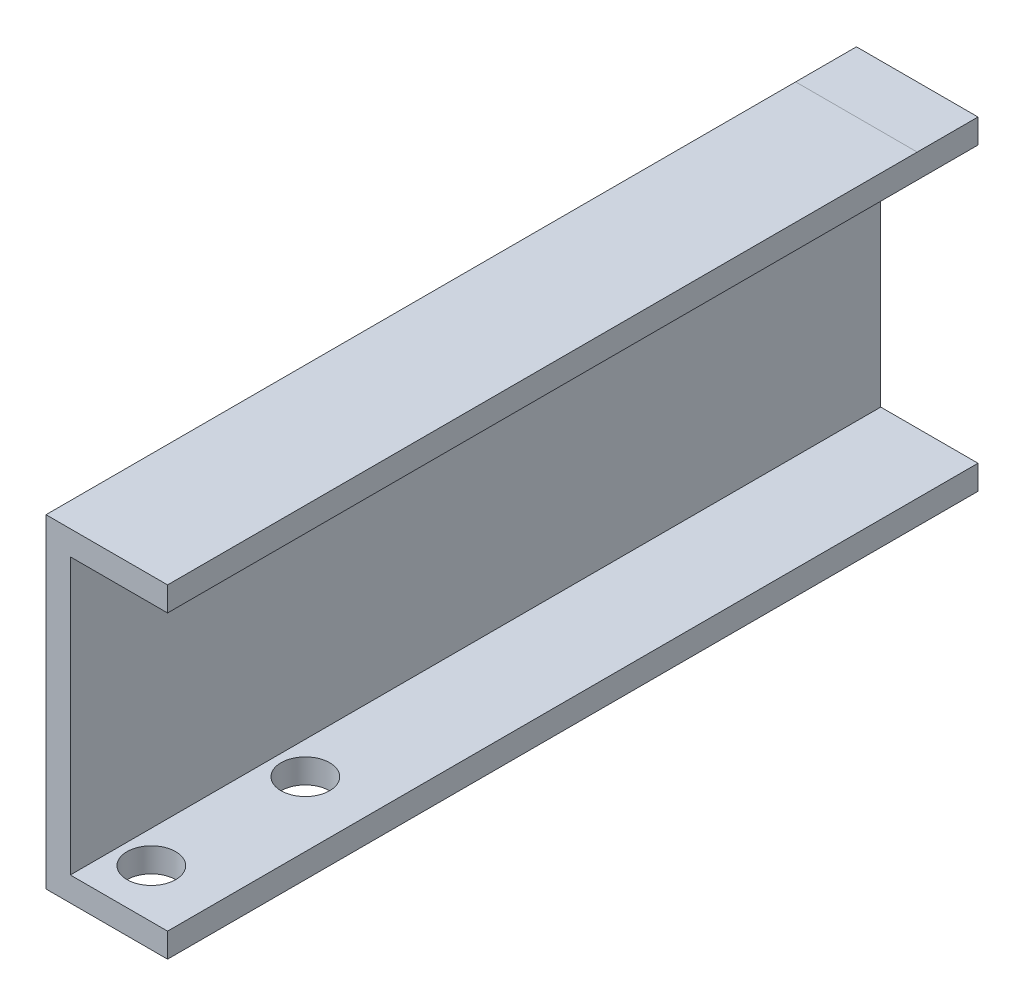
ISO-10303-21;
HEADER;
FILE_DESCRIPTION(('STEP AP214'),'2;1');
FILE_NAME('part.step','',(''),(''),'','','');
FILE_SCHEMA(('AUTOMOTIVE_DESIGN { 1 0 10303 214 1 1 1 1 }'));
ENDSEC;
DATA;
#1=APPLICATION_CONTEXT('core data for automotive mechanical design processes');
#2=APPLICATION_PROTOCOL_DEFINITION('international standard','automotive_design',2000,#1);
#3=PRODUCT_CONTEXT('',#1,'mechanical');
#4=PRODUCT('Part','Part','',(#3));
#5=PRODUCT_RELATED_PRODUCT_CATEGORY('part','',(#4));
#6=PRODUCT_DEFINITION_FORMATION('','',#4);
#7=PRODUCT_DEFINITION_CONTEXT('part definition',#1,'design');
#8=PRODUCT_DEFINITION('design','',#6,#7);
#9=PRODUCT_DEFINITION_SHAPE('','',#8);
#10=(LENGTH_UNIT() NAMED_UNIT(*) SI_UNIT(.MILLI.,.METRE.));
#11=(NAMED_UNIT(*) PLANE_ANGLE_UNIT() SI_UNIT($,.RADIAN.));
#12=(NAMED_UNIT(*) SI_UNIT($,.STERADIAN.) SOLID_ANGLE_UNIT());
#13=UNCERTAINTY_MEASURE_WITH_UNIT(LENGTH_MEASURE(1.E-05),#10,'distance_accuracy_value','');
#14=(GEOMETRIC_REPRESENTATION_CONTEXT(3) GLOBAL_UNCERTAINTY_ASSIGNED_CONTEXT((#13)) GLOBAL_UNIT_ASSIGNED_CONTEXT((#10,
#11,#12)) REPRESENTATION_CONTEXT('',''));
#15=CARTESIAN_POINT('',(0.,0.,0.));
#16=DIRECTION('',(0.,0.,1.));
#17=DIRECTION('',(1.,0.,0.));
#18=AXIS2_PLACEMENT_3D('',#15,#16,#17);
#19=CARTESIAN_POINT('',(0.,-40.,-200.));
#20=DIRECTION('',(0.,-1.,0.));
#21=DIRECTION('',(1.,0.,0.));
#22=AXIS2_PLACEMENT_3D('',#19,#20,#21);
#23=PLANE('',#22);
#24=DIRECTION('',(0.,0.,1.));
#25=VECTOR('',#24,1.);
#26=CARTESIAN_POINT('',(30.,-40.,-200.));
#27=LINE('',#26,#25);
#28=CARTESIAN_POINT('',(30.,-40.,-200.));
#29=VERTEX_POINT('',#28);
#30=CARTESIAN_POINT('',(30.,-40.,-60.));
#31=VERTEX_POINT('',#30);
#32=EDGE_CURVE('E131',#29,#31,#27,.T.);
#33=ORIENTED_EDGE('',*,*,#32,.T.);
#34=DIRECTION('',(-1.,0.,0.));
#35=VECTOR('',#34,1.);
#36=CARTESIAN_POINT('',(0.,-40.,-60.));
#37=LINE('',#36,#35);
#38=CARTESIAN_POINT('',(0.,-40.,-60.));
#39=VERTEX_POINT('',#38);
#40=EDGE_CURVE('E12',#31,#39,#37,.T.);
#41=ORIENTED_EDGE('',*,*,#40,.T.);
#42=DIRECTION('',(0.,0.,1.));
#43=VECTOR('',#42,1.);
#44=CARTESIAN_POINT('',(0.,-40.,-200.));
#45=LINE('',#44,#43);
#46=CARTESIAN_POINT('',(0.,-40.,-200.));
#47=VERTEX_POINT('',#46);
#48=EDGE_CURVE('E138',#47,#39,#45,.T.);
#49=ORIENTED_EDGE('',*,*,#48,.F.);
#50=DIRECTION('',(1.,0.,0.));
#51=VECTOR('',#50,1.);
#52=CARTESIAN_POINT('',(0.,-40.,-200.));
#53=LINE('',#52,#51);
#54=EDGE_CURVE('E123',#47,#29,#53,.T.);
#55=ORIENTED_EDGE('',*,*,#54,.T.);
#56=EDGE_LOOP('',(#33,#41,#49,#55));
#57=FACE_BOUND('',#56,.T.);
#58=ADVANCED_FACE('F43',(#57),#23,.T.);
#59=CARTESIAN_POINT('',(30.,40.,-200.));
#60=DIRECTION('',(0.,1.,0.));
#61=DIRECTION('',(-1.,0.,0.));
#62=AXIS2_PLACEMENT_3D('',#59,#60,#61);
#63=PLANE('',#62);
#64=DIRECTION('',(0.,0.,1.));
#65=VECTOR('',#64,1.);
#66=CARTESIAN_POINT('',(0.,40.,-200.));
#67=LINE('',#66,#65);
#68=CARTESIAN_POINT('',(0.,40.,-200.));
#69=VERTEX_POINT('',#68);
#70=CARTESIAN_POINT('',(0.,40.,-185.));
#71=VERTEX_POINT('',#70);
#72=EDGE_CURVE('E177',#69,#71,#67,.T.);
#73=ORIENTED_EDGE('',*,*,#72,.T.);
#74=DIRECTION('',(1.,0.,0.));
#75=VECTOR('',#74,1.);
#76=CARTESIAN_POINT('',(30.,40.,-185.));
#77=LINE('',#76,#75);
#78=CARTESIAN_POINT('',(30.,40.,-185.));
#79=VERTEX_POINT('',#78);
#80=EDGE_CURVE('E52',#71,#79,#77,.T.);
#81=ORIENTED_EDGE('',*,*,#80,.T.);
#82=DIRECTION('',(0.,0.,1.));
#83=VECTOR('',#82,1.);
#84=CARTESIAN_POINT('',(30.,40.,-200.));
#85=LINE('',#84,#83);
#86=CARTESIAN_POINT('',(30.,40.,-200.));
#87=VERTEX_POINT('',#86);
#88=EDGE_CURVE('E181',#87,#79,#85,.T.);
#89=ORIENTED_EDGE('',*,*,#88,.F.);
#90=DIRECTION('',(-1.,0.,0.));
#91=VECTOR('',#90,1.);
#92=CARTESIAN_POINT('',(30.,40.,-200.));
#93=LINE('',#92,#91);
#94=EDGE_CURVE('E155',#87,#69,#93,.T.);
#95=ORIENTED_EDGE('',*,*,#94,.T.);
#96=EDGE_LOOP('',(#73,#81,#89,#95));
#97=FACE_BOUND('',#96,.T.);
#98=ADVANCED_FACE('F220',(#97),#63,.T.);
#99=CARTESIAN_POINT('',(14.,-40.,-12.));
#100=DIRECTION('',(0.,-1.,0.));
#101=DIRECTION('',(1.,0.,0.));
#102=AXIS2_PLACEMENT_3D('',#99,#100,#101);
#103=CIRCLE('',#102,6.);
#104=CARTESIAN_POINT('',(20.,-40.,-12.));
#105=VERTEX_POINT('',#104);
#106=EDGE_CURVE('E197',#105,#105,#103,.T.);
#107=ORIENTED_EDGE('',*,*,#106,.F.);
#108=EDGE_LOOP('',(#107));
#109=FACE_BOUND('',#108,.T.);
#110=CARTESIAN_POINT('',(14.,-40.,-50.));
#111=DIRECTION('',(0.,-1.,0.));
#112=DIRECTION('',(1.,0.,0.));
#113=AXIS2_PLACEMENT_3D('',#110,#111,#112);
#114=CIRCLE('',#113,6.);
#115=CARTESIAN_POINT('',(20.,-40.,-50.));
#116=VERTEX_POINT('',#115);
#117=EDGE_CURVE('E145',#116,#116,#114,.T.);
#118=ORIENTED_EDGE('',*,*,#117,.F.);
#119=EDGE_LOOP('',(#118));
#120=FACE_BOUND('',#119,.T.);
#121=ORIENTED_EDGE('',*,*,#40,.F.);
#122=CARTESIAN_POINT('',(30.,-40.,0.));
#123=VERTEX_POINT('',#122);
#124=EDGE_CURVE('E134',#31,#123,#27,.T.);
#125=ORIENTED_EDGE('',*,*,#124,.T.);
#126=DIRECTION('',(1.,0.,0.));
#127=VECTOR('',#126,1.);
#128=CARTESIAN_POINT('',(0.,-40.,0.));
#129=LINE('',#128,#127);
#130=CARTESIAN_POINT('',(0.,-40.,0.));
#131=VERTEX_POINT('',#130);
#132=EDGE_CURVE('E160',#131,#123,#129,.T.);
#133=ORIENTED_EDGE('',*,*,#132,.F.);
#134=EDGE_CURVE('E176',#39,#131,#45,.T.);
#135=ORIENTED_EDGE('',*,*,#134,.F.);
#136=EDGE_LOOP('',(#121,#125,#133,#135));
#137=FACE_BOUND('',#136,.T.);
#138=ADVANCED_FACE('F45',(#109,#120,#137),#23,.T.);
#139=CARTESIAN_POINT('',(0.,40.,-200.));
#140=DIRECTION('',(-1.,0.,0.));
#141=DIRECTION('',(0.,-1.,0.));
#142=AXIS2_PLACEMENT_3D('',#139,#140,#141);
#143=PLANE('',#142);
#144=DIRECTION('',(0.,-1.,0.));
#145=VECTOR('',#144,1.);
#146=CARTESIAN_POINT('',(0.,40.,0.));
#147=LINE('',#146,#145);
#148=CARTESIAN_POINT('',(0.,40.,0.));
#149=VERTEX_POINT('',#148);
#150=EDGE_CURVE('E139',#149,#131,#147,.T.);
#151=ORIENTED_EDGE('',*,*,#150,.F.);
#152=EDGE_CURVE('E180',#71,#149,#67,.T.);
#153=ORIENTED_EDGE('',*,*,#152,.F.);
#154=ORIENTED_EDGE('',*,*,#72,.F.);
#155=DIRECTION('',(0.,-1.,0.));
#156=VECTOR('',#155,1.);
#157=CARTESIAN_POINT('',(0.,40.,-200.));
#158=LINE('',#157,#156);
#159=EDGE_CURVE('E158',#69,#47,#158,.T.);
#160=ORIENTED_EDGE('',*,*,#159,.T.);
#161=ORIENTED_EDGE('',*,*,#48,.T.);
#162=ORIENTED_EDGE('',*,*,#134,.T.);
#163=EDGE_LOOP('',(#151,#153,#154,#160,#161,#162));
#164=FACE_BOUND('',#163,.T.);
#165=ADVANCED_FACE('F228',(#164),#143,.T.);
#166=ORIENTED_EDGE('',*,*,#80,.F.);
#167=ORIENTED_EDGE('',*,*,#152,.T.);
#168=DIRECTION('',(-1.,0.,0.));
#169=VECTOR('',#168,1.);
#170=CARTESIAN_POINT('',(30.,40.,0.));
#171=LINE('',#170,#169);
#172=CARTESIAN_POINT('',(30.,40.,0.));
#173=VERTEX_POINT('',#172);
#174=EDGE_CURVE('E142',#173,#149,#171,.T.);
#175=ORIENTED_EDGE('',*,*,#174,.F.);
#176=EDGE_CURVE('E184',#79,#173,#85,.T.);
#177=ORIENTED_EDGE('',*,*,#176,.F.);
#178=EDGE_LOOP('',(#166,#167,#175,#177));
#179=FACE_BOUND('',#178,.T.);
#180=ADVANCED_FACE('F226',(#179),#63,.T.);
#181=CARTESIAN_POINT('',(30.,40.,-200.));
#182=DIRECTION('',(-1.,0.,0.));
#183=DIRECTION('',(0.,-1.,0.));
#184=AXIS2_PLACEMENT_3D('',#181,#182,#183);
#185=PLANE('',#184);
#186=DIRECTION('',(0.,-1.,0.));
#187=VECTOR('',#186,1.);
#188=CARTESIAN_POINT('',(30.,40.,0.));
#189=LINE('',#188,#187);
#190=CARTESIAN_POINT('',(30.,34.,0.));
#191=VERTEX_POINT('',#190);
#192=EDGE_CURVE('E171',#173,#191,#189,.T.);
#193=ORIENTED_EDGE('',*,*,#192,.T.);
#194=DIRECTION('',(0.,0.,1.));
#195=VECTOR('',#194,1.);
#196=CARTESIAN_POINT('',(30.,34.,-200.));
#197=LINE('',#196,#195);
#198=CARTESIAN_POINT('',(30.,34.,-200.));
#199=VERTEX_POINT('',#198);
#200=EDGE_CURVE('E185',#199,#191,#197,.T.);
#201=ORIENTED_EDGE('',*,*,#200,.F.);
#202=DIRECTION('',(0.,-1.,0.));
#203=VECTOR('',#202,1.);
#204=CARTESIAN_POINT('',(30.,40.,-200.));
#205=LINE('',#204,#203);
#206=EDGE_CURVE('E153',#87,#199,#205,.T.);
#207=ORIENTED_EDGE('',*,*,#206,.F.);
#208=ORIENTED_EDGE('',*,*,#88,.T.);
#209=ORIENTED_EDGE('',*,*,#176,.T.);
#210=EDGE_LOOP('',(#193,#201,#207,#208,#209));
#211=FACE_BOUND('',#210,.T.);
#212=ADVANCED_FACE('F241',(#211),#185,.F.);
#213=CARTESIAN_POINT('',(30.,34.,-200.));
#214=DIRECTION('',(0.,1.,0.));
#215=DIRECTION('',(-1.,0.,0.));
#216=AXIS2_PLACEMENT_3D('',#213,#214,#215);
#217=PLANE('',#216);
#218=DIRECTION('',(-1.,0.,0.));
#219=VECTOR('',#218,1.);
#220=CARTESIAN_POINT('',(30.,34.,0.));
#221=LINE('',#220,#219);
#222=CARTESIAN_POINT('',(5.99999999999998,34.,0.));
#223=VERTEX_POINT('',#222);
#224=EDGE_CURVE('E169',#191,#223,#221,.T.);
#225=ORIENTED_EDGE('',*,*,#224,.T.);
#226=DIRECTION('',(0.,0.,1.));
#227=VECTOR('',#226,1.);
#228=CARTESIAN_POINT('',(5.99999999999998,34.,-200.));
#229=LINE('',#228,#227);
#230=CARTESIAN_POINT('',(5.99999999999998,34.,-200.));
#231=VERTEX_POINT('',#230);
#232=EDGE_CURVE('E188',#231,#223,#229,.T.);
#233=ORIENTED_EDGE('',*,*,#232,.F.);
#234=DIRECTION('',(-1.,0.,0.));
#235=VECTOR('',#234,1.);
#236=CARTESIAN_POINT('',(30.,34.,-200.));
#237=LINE('',#236,#235);
#238=EDGE_CURVE('E151',#199,#231,#237,.T.);
#239=ORIENTED_EDGE('',*,*,#238,.F.);
#240=ORIENTED_EDGE('',*,*,#200,.T.);
#241=EDGE_LOOP('',(#225,#233,#239,#240));
#242=FACE_BOUND('',#241,.T.);
#243=ADVANCED_FACE('F249',(#242),#217,.F.);
#244=CARTESIAN_POINT('',(5.99999999999998,40.,-200.));
#245=DIRECTION('',(-1.,0.,0.));
#246=DIRECTION('',(0.,-1.,0.));
#247=AXIS2_PLACEMENT_3D('',#244,#245,#246);
#248=PLANE('',#247);
#249=DIRECTION('',(0.,-1.,0.));
#250=VECTOR('',#249,1.);
#251=CARTESIAN_POINT('',(5.99999999999998,40.,0.));
#252=LINE('',#251,#250);
#253=CARTESIAN_POINT('',(6.,-34.,0.));
#254=VERTEX_POINT('',#253);
#255=EDGE_CURVE('E167',#223,#254,#252,.T.);
#256=ORIENTED_EDGE('',*,*,#255,.T.);
#257=DIRECTION('',(0.,0.,1.));
#258=VECTOR('',#257,1.);
#259=CARTESIAN_POINT('',(6.,-34.,-200.));
#260=LINE('',#259,#258);
#261=CARTESIAN_POINT('',(6.,-34.,-200.));
#262=VERTEX_POINT('',#261);
#263=EDGE_CURVE('E191',#262,#254,#260,.T.);
#264=ORIENTED_EDGE('',*,*,#263,.F.);
#265=DIRECTION('',(0.,-1.,0.));
#266=VECTOR('',#265,1.);
#267=CARTESIAN_POINT('',(5.99999999999998,40.,-200.));
#268=LINE('',#267,#266);
#269=EDGE_CURVE('E149',#231,#262,#268,.T.);
#270=ORIENTED_EDGE('',*,*,#269,.F.);
#271=ORIENTED_EDGE('',*,*,#232,.T.);
#272=EDGE_LOOP('',(#256,#264,#270,#271));
#273=FACE_BOUND('',#272,.T.);
#274=ADVANCED_FACE('F253',(#273),#248,.F.);
#275=CARTESIAN_POINT('',(0.,-34.,-200.));
#276=DIRECTION('',(0.,-1.,0.));
#277=DIRECTION('',(1.,0.,0.));
#278=AXIS2_PLACEMENT_3D('',#275,#276,#277);
#279=PLANE('',#278);
#280=CARTESIAN_POINT('',(14.,-34.,-12.));
#281=DIRECTION('',(0.,-1.,0.));
#282=DIRECTION('',(1.,0.,0.));
#283=AXIS2_PLACEMENT_3D('',#280,#281,#282);
#284=CIRCLE('',#283,6.);
#285=CARTESIAN_POINT('',(20.,-34.,-12.));
#286=VERTEX_POINT('',#285);
#287=EDGE_CURVE('E47',#286,#286,#284,.T.);
#288=ORIENTED_EDGE('',*,*,#287,.T.);
#289=EDGE_LOOP('',(#288));
#290=FACE_BOUND('',#289,.T.);
#291=CARTESIAN_POINT('',(14.,-34.,-50.));
#292=DIRECTION('',(0.,-1.,0.));
#293=DIRECTION('',(1.,0.,0.));
#294=AXIS2_PLACEMENT_3D('',#291,#292,#293);
#295=CIRCLE('',#294,6.);
#296=CARTESIAN_POINT('',(20.,-34.,-50.));
#297=VERTEX_POINT('',#296);
#298=EDGE_CURVE('E195',#297,#297,#295,.T.);
#299=ORIENTED_EDGE('',*,*,#298,.T.);
#300=EDGE_LOOP('',(#299));
#301=FACE_BOUND('',#300,.T.);
#302=DIRECTION('',(1.,0.,0.));
#303=VECTOR('',#302,1.);
#304=CARTESIAN_POINT('',(0.,-34.,0.));
#305=LINE('',#304,#303);
#306=CARTESIAN_POINT('',(30.,-34.,0.));
#307=VERTEX_POINT('',#306);
#308=EDGE_CURVE('E165',#254,#307,#305,.T.);
#309=ORIENTED_EDGE('',*,*,#308,.T.);
#310=DIRECTION('',(0.,0.,1.));
#311=VECTOR('',#310,1.);
#312=CARTESIAN_POINT('',(30.,-34.,-200.));
#313=LINE('',#312,#311);
#314=CARTESIAN_POINT('',(30.,-34.,-200.));
#315=VERTEX_POINT('',#314);
#316=EDGE_CURVE('E135',#315,#307,#313,.T.);
#317=ORIENTED_EDGE('',*,*,#316,.F.);
#318=DIRECTION('',(1.,0.,0.));
#319=VECTOR('',#318,1.);
#320=CARTESIAN_POINT('',(0.,-34.,-200.));
#321=LINE('',#320,#319);
#322=EDGE_CURVE('E126',#262,#315,#321,.T.);
#323=ORIENTED_EDGE('',*,*,#322,.F.);
#324=ORIENTED_EDGE('',*,*,#263,.T.);
#325=EDGE_LOOP('',(#309,#317,#323,#324));
#326=FACE_BOUND('',#325,.T.);
#327=ADVANCED_FACE('F207',(#290,#301,#326),#279,.F.);
#328=CARTESIAN_POINT('',(30.,-34.,-200.));
#329=DIRECTION('',(-1.,0.,0.));
#330=DIRECTION('',(0.,0.,1.));
#331=AXIS2_PLACEMENT_3D('',#328,#329,#330);
#332=PLANE('',#331);
#333=DIRECTION('',(0.,-1.,0.));
#334=VECTOR('',#333,1.);
#335=CARTESIAN_POINT('',(30.,-34.,0.));
#336=LINE('',#335,#334);
#337=EDGE_CURVE('E163',#307,#123,#336,.T.);
#338=ORIENTED_EDGE('',*,*,#337,.T.);
#339=ORIENTED_EDGE('',*,*,#124,.F.);
#340=ORIENTED_EDGE('',*,*,#32,.F.);
#341=DIRECTION('',(0.,-1.,0.));
#342=VECTOR('',#341,1.);
#343=CARTESIAN_POINT('',(30.,-34.,-200.));
#344=LINE('',#343,#342);
#345=EDGE_CURVE('E118',#315,#29,#344,.T.);
#346=ORIENTED_EDGE('',*,*,#345,.F.);
#347=ORIENTED_EDGE('',*,*,#316,.T.);
#348=EDGE_LOOP('',(#338,#339,#340,#346,#347));
#349=FACE_BOUND('',#348,.T.);
#350=ADVANCED_FACE('F133',(#349),#332,.F.);
#351=CARTESIAN_POINT('',(0.,0.,-200.));
#352=DIRECTION('',(0.,0.,-1.));
#353=DIRECTION('',(-1.,0.,0.));
#354=AXIS2_PLACEMENT_3D('',#351,#352,#353);
#355=PLANE('',#354);
#356=ORIENTED_EDGE('',*,*,#54,.F.);
#357=ORIENTED_EDGE('',*,*,#159,.F.);
#358=ORIENTED_EDGE('',*,*,#94,.F.);
#359=ORIENTED_EDGE('',*,*,#206,.T.);
#360=ORIENTED_EDGE('',*,*,#238,.T.);
#361=ORIENTED_EDGE('',*,*,#269,.T.);
#362=ORIENTED_EDGE('',*,*,#322,.T.);
#363=ORIENTED_EDGE('',*,*,#345,.T.);
#364=EDGE_LOOP('',(#356,#357,#358,#359,#360,#361,#362,#363));
#365=FACE_BOUND('',#364,.T.);
#366=ADVANCED_FACE('F120',(#365),#355,.T.);
#367=CARTESIAN_POINT('',(0.,0.,0.));
#368=DIRECTION('',(0.,0.,-1.));
#369=DIRECTION('',(-1.,0.,0.));
#370=AXIS2_PLACEMENT_3D('',#367,#368,#369);
#371=PLANE('',#370);
#372=ORIENTED_EDGE('',*,*,#132,.T.);
#373=ORIENTED_EDGE('',*,*,#337,.F.);
#374=ORIENTED_EDGE('',*,*,#308,.F.);
#375=ORIENTED_EDGE('',*,*,#255,.F.);
#376=ORIENTED_EDGE('',*,*,#224,.F.);
#377=ORIENTED_EDGE('',*,*,#192,.F.);
#378=ORIENTED_EDGE('',*,*,#174,.T.);
#379=ORIENTED_EDGE('',*,*,#150,.T.);
#380=EDGE_LOOP('',(#372,#373,#374,#375,#376,#377,#378,#379));
#381=FACE_BOUND('',#380,.T.);
#382=ADVANCED_FACE('F216',(#381),#371,.F.);
#383=CARTESIAN_POINT('',(14.,-60.,-50.));
#384=DIRECTION('',(0.,1.,0.));
#385=DIRECTION('',(0.,0.,1.));
#386=AXIS2_PLACEMENT_3D('',#383,#384,#385);
#387=CYLINDRICAL_SURFACE('',#386,6.);
#388=ORIENTED_EDGE('',*,*,#117,.T.);
#389=EDGE_LOOP('',(#388));
#390=FACE_BOUND('',#389,.T.);
#391=ORIENTED_EDGE('',*,*,#298,.F.);
#392=EDGE_LOOP('',(#391));
#393=FACE_BOUND('',#392,.T.);
#394=ADVANCED_FACE('F211',(#390,#393),#387,.F.);
#395=CARTESIAN_POINT('',(14.,-60.,-12.));
#396=DIRECTION('',(0.,1.,0.));
#397=DIRECTION('',(0.,0.,1.));
#398=AXIS2_PLACEMENT_3D('',#395,#396,#397);
#399=CYLINDRICAL_SURFACE('',#398,6.);
#400=ORIENTED_EDGE('',*,*,#106,.T.);
#401=EDGE_LOOP('',(#400));
#402=FACE_BOUND('',#401,.T.);
#403=ORIENTED_EDGE('',*,*,#287,.F.);
#404=EDGE_LOOP('',(#403));
#405=FACE_BOUND('',#404,.T.);
#406=ADVANCED_FACE('F209',(#402,#405),#399,.F.);
#407=CLOSED_SHELL('',(#58,#98,#138,#165,#180,#212,#243,#274,#327,#350,#366,#382,#394,#406));
#408=MANIFOLD_SOLID_BREP('B2',#407);
#409=ADVANCED_BREP_SHAPE_REPRESENTATION('',(#18,#408),#14);
#410=SHAPE_DEFINITION_REPRESENTATION(#9,#409);
ENDSEC;
END-ISO-10303-21;
